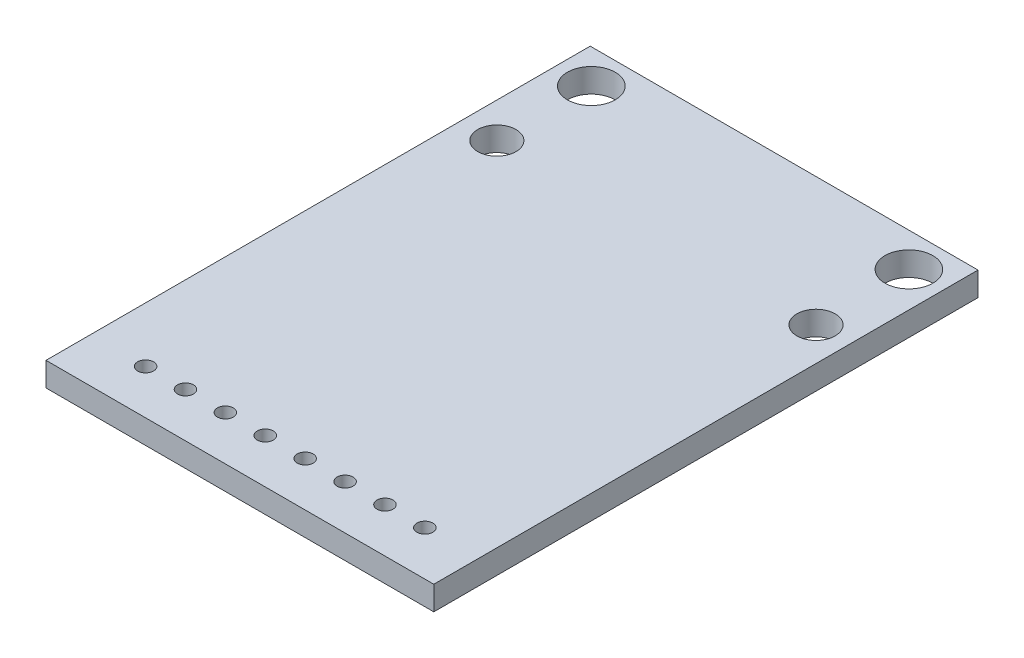
ISO-10303-21;
HEADER;
FILE_DESCRIPTION(('STEP AP214'),'2;1');
FILE_NAME('part.step','',(''),(''),'','','');
FILE_SCHEMA(('AUTOMOTIVE_DESIGN { 1 0 10303 214 1 1 1 1 }'));
ENDSEC;
DATA;
#1=APPLICATION_CONTEXT('core data for automotive mechanical design processes');
#2=APPLICATION_PROTOCOL_DEFINITION('international standard','automotive_design',2000,#1);
#3=PRODUCT_CONTEXT('',#1,'mechanical');
#4=PRODUCT('Part','Part','',(#3));
#5=PRODUCT_RELATED_PRODUCT_CATEGORY('part','',(#4));
#6=PRODUCT_DEFINITION_FORMATION('','',#4);
#7=PRODUCT_DEFINITION_CONTEXT('part definition',#1,'design');
#8=PRODUCT_DEFINITION('design','',#6,#7);
#9=PRODUCT_DEFINITION_SHAPE('','',#8);
#10=(LENGTH_UNIT() NAMED_UNIT(*) SI_UNIT(.MILLI.,.METRE.));
#11=(NAMED_UNIT(*) PLANE_ANGLE_UNIT() SI_UNIT($,.RADIAN.));
#12=(NAMED_UNIT(*) SI_UNIT($,.STERADIAN.) SOLID_ANGLE_UNIT());
#13=UNCERTAINTY_MEASURE_WITH_UNIT(LENGTH_MEASURE(1.E-05),#10,'distance_accuracy_value','');
#14=(GEOMETRIC_REPRESENTATION_CONTEXT(3) GLOBAL_UNCERTAINTY_ASSIGNED_CONTEXT((#13)) GLOBAL_UNIT_ASSIGNED_CONTEXT((#10,
#11,#12)) REPRESENTATION_CONTEXT('',''));
#15=CARTESIAN_POINT('',(0.,0.,0.));
#16=DIRECTION('',(0.,0.,1.));
#17=DIRECTION('',(1.,0.,0.));
#18=AXIS2_PLACEMENT_3D('',#15,#16,#17);
#19=CARTESIAN_POINT('',(12.15,1.5,-17.05));
#20=DIRECTION('',(-1.,0.,0.));
#21=DIRECTION('',(0.,0.,1.));
#22=AXIS2_PLACEMENT_3D('',#19,#20,#21);
#23=PLANE('',#22);
#24=DIRECTION('',(0.,0.,-1.));
#25=VECTOR('',#24,1.);
#26=CARTESIAN_POINT('',(12.15,0.,-17.05));
#27=LINE('',#26,#25);
#28=CARTESIAN_POINT('',(12.15,0.,17.05));
#29=VERTEX_POINT('',#28);
#30=CARTESIAN_POINT('',(12.15,0.,-17.05));
#31=VERTEX_POINT('',#30);
#32=EDGE_CURVE('E98',#29,#31,#27,.T.);
#33=ORIENTED_EDGE('',*,*,#32,.T.);
#34=DIRECTION('',(0.,-1.,0.));
#35=VECTOR('',#34,1.);
#36=CARTESIAN_POINT('',(12.15,1.5,-17.05));
#37=LINE('',#36,#35);
#38=CARTESIAN_POINT('',(12.15,1.5,-17.05));
#39=VERTEX_POINT('',#38);
#40=EDGE_CURVE('E11',#39,#31,#37,.T.);
#41=ORIENTED_EDGE('',*,*,#40,.F.);
#42=DIRECTION('',(0.,0.,-1.));
#43=VECTOR('',#42,1.);
#44=CARTESIAN_POINT('',(12.15,1.5,-17.05));
#45=LINE('',#44,#43);
#46=CARTESIAN_POINT('',(12.15,1.5,17.05));
#47=VERTEX_POINT('',#46);
#48=EDGE_CURVE('E86',#47,#39,#45,.T.);
#49=ORIENTED_EDGE('',*,*,#48,.F.);
#50=DIRECTION('',(0.,-1.,0.));
#51=VECTOR('',#50,1.);
#52=CARTESIAN_POINT('',(12.15,1.5,17.05));
#53=LINE('',#52,#51);
#54=EDGE_CURVE('E94',#47,#29,#53,.T.);
#55=ORIENTED_EDGE('',*,*,#54,.T.);
#56=EDGE_LOOP('',(#33,#41,#49,#55));
#57=FACE_BOUND('',#56,.T.);
#58=ADVANCED_FACE('F35',(#57),#23,.F.);
#59=CARTESIAN_POINT('',(-12.15,1.5,-17.05));
#60=DIRECTION('',(0.,0.,1.));
#61=DIRECTION('',(1.,0.,0.));
#62=AXIS2_PLACEMENT_3D('',#59,#60,#61);
#63=PLANE('',#62);
#64=DIRECTION('',(-1.,0.,0.));
#65=VECTOR('',#64,1.);
#66=CARTESIAN_POINT('',(-12.15,0.,-17.05));
#67=LINE('',#66,#65);
#68=CARTESIAN_POINT('',(-12.15,0.,-17.05));
#69=VERTEX_POINT('',#68);
#70=EDGE_CURVE('E90',#31,#69,#67,.T.);
#71=ORIENTED_EDGE('',*,*,#70,.T.);
#72=DIRECTION('',(0.,-1.,0.));
#73=VECTOR('',#72,1.);
#74=CARTESIAN_POINT('',(-12.15,1.5,-17.05));
#75=LINE('',#74,#73);
#76=CARTESIAN_POINT('',(-12.15,1.5,-17.05));
#77=VERTEX_POINT('',#76);
#78=EDGE_CURVE('E43',#77,#69,#75,.T.);
#79=ORIENTED_EDGE('',*,*,#78,.F.);
#80=DIRECTION('',(-1.,0.,0.));
#81=VECTOR('',#80,1.);
#82=CARTESIAN_POINT('',(-12.15,1.5,-17.05));
#83=LINE('',#82,#81);
#84=EDGE_CURVE('E81',#39,#77,#83,.T.);
#85=ORIENTED_EDGE('',*,*,#84,.F.);
#86=ORIENTED_EDGE('',*,*,#40,.T.);
#87=EDGE_LOOP('',(#71,#79,#85,#86));
#88=FACE_BOUND('',#87,.T.);
#89=ADVANCED_FACE('F89',(#88),#63,.F.);
#90=CARTESIAN_POINT('',(-12.15,1.5,-17.05));
#91=DIRECTION('',(1.,0.,0.));
#92=DIRECTION('',(0.,0.,-1.));
#93=AXIS2_PLACEMENT_3D('',#90,#91,#92);
#94=PLANE('',#93);
#95=DIRECTION('',(0.,0.,1.));
#96=VECTOR('',#95,1.);
#97=CARTESIAN_POINT('',(-12.15,0.,-17.05));
#98=LINE('',#97,#96);
#99=CARTESIAN_POINT('',(-12.15,0.,17.05));
#100=VERTEX_POINT('',#99);
#101=EDGE_CURVE('E68',#69,#100,#98,.T.);
#102=ORIENTED_EDGE('',*,*,#101,.T.);
#103=DIRECTION('',(0.,-1.,0.));
#104=VECTOR('',#103,1.);
#105=CARTESIAN_POINT('',(-12.15,1.5,17.05));
#106=LINE('',#105,#104);
#107=CARTESIAN_POINT('',(-12.15,1.5,17.05));
#108=VERTEX_POINT('',#107);
#109=EDGE_CURVE('E91',#108,#100,#106,.T.);
#110=ORIENTED_EDGE('',*,*,#109,.F.);
#111=DIRECTION('',(0.,0.,1.));
#112=VECTOR('',#111,1.);
#113=CARTESIAN_POINT('',(-12.15,1.5,-17.05));
#114=LINE('',#113,#112);
#115=EDGE_CURVE('E84',#77,#108,#114,.T.);
#116=ORIENTED_EDGE('',*,*,#115,.F.);
#117=ORIENTED_EDGE('',*,*,#78,.T.);
#118=EDGE_LOOP('',(#102,#110,#116,#117));
#119=FACE_BOUND('',#118,.T.);
#120=ADVANCED_FACE('F92',(#119),#94,.F.);
#121=CARTESIAN_POINT('',(-12.15,1.5,17.05));
#122=DIRECTION('',(0.,0.,-1.));
#123=DIRECTION('',(-1.,0.,0.));
#124=AXIS2_PLACEMENT_3D('',#121,#122,#123);
#125=PLANE('',#124);
#126=DIRECTION('',(1.,0.,0.));
#127=VECTOR('',#126,1.);
#128=CARTESIAN_POINT('',(-12.15,0.,17.05));
#129=LINE('',#128,#127);
#130=EDGE_CURVE('E74',#100,#29,#129,.T.);
#131=ORIENTED_EDGE('',*,*,#130,.T.);
#132=ORIENTED_EDGE('',*,*,#54,.F.);
#133=DIRECTION('',(1.,0.,0.));
#134=VECTOR('',#133,1.);
#135=CARTESIAN_POINT('',(-12.15,1.5,17.05));
#136=LINE('',#135,#134);
#137=EDGE_CURVE('E51',#108,#47,#136,.T.);
#138=ORIENTED_EDGE('',*,*,#137,.F.);
#139=ORIENTED_EDGE('',*,*,#109,.T.);
#140=EDGE_LOOP('',(#131,#132,#138,#139));
#141=FACE_BOUND('',#140,.T.);
#142=ADVANCED_FACE('F106',(#141),#125,.F.);
#143=CARTESIAN_POINT('',(0.,1.5,0.));
#144=DIRECTION('',(0.,1.,0.));
#145=DIRECTION('',(0.,0.,1.));
#146=AXIS2_PLACEMENT_3D('',#143,#144,#145);
#147=PLANE('',#146);
#148=CARTESIAN_POINT('',(8.8,1.5,14.26));
#149=DIRECTION('',(0.,1.,0.));
#150=DIRECTION('',(0.,0.,1.));
#151=AXIS2_PLACEMENT_3D('',#148,#149,#150);
#152=CIRCLE('',#151,0.500000000000001);
#153=CARTESIAN_POINT('',(8.8,1.5,14.76));
#154=VERTEX_POINT('',#153);
#155=EDGE_CURVE('E180',#154,#154,#152,.T.);
#156=ORIENTED_EDGE('',*,*,#155,.F.);
#157=EDGE_LOOP('',(#156));
#158=FACE_BOUND('',#157,.T.);
#159=CARTESIAN_POINT('',(6.3,1.5,14.26));
#160=DIRECTION('',(0.,1.,0.));
#161=DIRECTION('',(0.,0.,1.));
#162=AXIS2_PLACEMENT_3D('',#159,#160,#161);
#163=CIRCLE('',#162,0.500000000000001);
#164=CARTESIAN_POINT('',(6.3,1.5,14.76));
#165=VERTEX_POINT('',#164);
#166=EDGE_CURVE('E174',#165,#165,#163,.T.);
#167=ORIENTED_EDGE('',*,*,#166,.F.);
#168=EDGE_LOOP('',(#167));
#169=FACE_BOUND('',#168,.T.);
#170=CARTESIAN_POINT('',(3.8,1.5,14.26));
#171=DIRECTION('',(0.,1.,0.));
#172=DIRECTION('',(0.,0.,1.));
#173=AXIS2_PLACEMENT_3D('',#170,#171,#172);
#174=CIRCLE('',#173,0.500000000000001);
#175=CARTESIAN_POINT('',(3.8,1.5,14.76));
#176=VERTEX_POINT('',#175);
#177=EDGE_CURVE('E168',#176,#176,#174,.T.);
#178=ORIENTED_EDGE('',*,*,#177,.F.);
#179=EDGE_LOOP('',(#178));
#180=FACE_BOUND('',#179,.T.);
#181=CARTESIAN_POINT('',(1.3,1.5,14.26));
#182=DIRECTION('',(0.,1.,0.));
#183=DIRECTION('',(0.,0.,1.));
#184=AXIS2_PLACEMENT_3D('',#181,#182,#183);
#185=CIRCLE('',#184,0.500000000000001);
#186=CARTESIAN_POINT('',(1.3,1.5,14.76));
#187=VERTEX_POINT('',#186);
#188=EDGE_CURVE('E162',#187,#187,#185,.T.);
#189=ORIENTED_EDGE('',*,*,#188,.F.);
#190=EDGE_LOOP('',(#189));
#191=FACE_BOUND('',#190,.T.);
#192=CARTESIAN_POINT('',(-1.2,1.5,14.26));
#193=DIRECTION('',(0.,1.,0.));
#194=DIRECTION('',(0.,0.,1.));
#195=AXIS2_PLACEMENT_3D('',#192,#193,#194);
#196=CIRCLE('',#195,0.500000000000001);
#197=CARTESIAN_POINT('',(-1.2,1.5,14.76));
#198=VERTEX_POINT('',#197);
#199=EDGE_CURVE('E156',#198,#198,#196,.T.);
#200=ORIENTED_EDGE('',*,*,#199,.F.);
#201=EDGE_LOOP('',(#200));
#202=FACE_BOUND('',#201,.T.);
#203=CARTESIAN_POINT('',(-3.7,1.5,14.26));
#204=DIRECTION('',(0.,1.,0.));
#205=DIRECTION('',(0.,0.,1.));
#206=AXIS2_PLACEMENT_3D('',#203,#204,#205);
#207=CIRCLE('',#206,0.500000000000001);
#208=CARTESIAN_POINT('',(-3.7,1.5,14.76));
#209=VERTEX_POINT('',#208);
#210=EDGE_CURVE('E150',#209,#209,#207,.T.);
#211=ORIENTED_EDGE('',*,*,#210,.F.);
#212=EDGE_LOOP('',(#211));
#213=FACE_BOUND('',#212,.T.);
#214=CARTESIAN_POINT('',(-6.2,1.5,14.26));
#215=DIRECTION('',(0.,1.,0.));
#216=DIRECTION('',(0.,0.,1.));
#217=AXIS2_PLACEMENT_3D('',#214,#215,#216);
#218=CIRCLE('',#217,0.500000000000001);
#219=CARTESIAN_POINT('',(-6.2,1.5,14.76));
#220=VERTEX_POINT('',#219);
#221=EDGE_CURVE('E144',#220,#220,#218,.T.);
#222=ORIENTED_EDGE('',*,*,#221,.F.);
#223=EDGE_LOOP('',(#222));
#224=FACE_BOUND('',#223,.T.);
#225=CARTESIAN_POINT('',(-8.7,1.5,14.26));
#226=DIRECTION('',(0.,1.,0.));
#227=DIRECTION('',(0.,0.,1.));
#228=AXIS2_PLACEMENT_3D('',#225,#226,#227);
#229=CIRCLE('',#228,0.500000000000001);
#230=CARTESIAN_POINT('',(-8.7,1.5,14.76));
#231=VERTEX_POINT('',#230);
#232=EDGE_CURVE('E138',#231,#231,#229,.T.);
#233=ORIENTED_EDGE('',*,*,#232,.F.);
#234=EDGE_LOOP('',(#233));
#235=FACE_BOUND('',#234,.T.);
#236=CARTESIAN_POINT('',(-9.95,1.5,-9.));
#237=DIRECTION('',(0.,1.,0.));
#238=DIRECTION('',(0.,0.,1.));
#239=AXIS2_PLACEMENT_3D('',#236,#237,#238);
#240=CIRCLE('',#239,1.19999999999999);
#241=CARTESIAN_POINT('',(-9.95,1.5,-7.80000000000001));
#242=VERTEX_POINT('',#241);
#243=EDGE_CURVE('E132',#242,#242,#240,.T.);
#244=ORIENTED_EDGE('',*,*,#243,.F.);
#245=EDGE_LOOP('',(#244));
#246=FACE_BOUND('',#245,.T.);
#247=CARTESIAN_POINT('',(10.05,1.5,-9.));
#248=DIRECTION('',(0.,1.,0.));
#249=DIRECTION('',(0.,0.,1.));
#250=AXIS2_PLACEMENT_3D('',#247,#248,#249);
#251=CIRCLE('',#250,1.19999999999999);
#252=CARTESIAN_POINT('',(10.05,1.5,-7.80000000000001));
#253=VERTEX_POINT('',#252);
#254=EDGE_CURVE('E126',#253,#253,#251,.T.);
#255=ORIENTED_EDGE('',*,*,#254,.F.);
#256=EDGE_LOOP('',(#255));
#257=FACE_BOUND('',#256,.T.);
#258=CARTESIAN_POINT('',(-9.95,1.5,-14.92));
#259=DIRECTION('',(0.,1.,0.));
#260=DIRECTION('',(0.,0.,1.));
#261=AXIS2_PLACEMENT_3D('',#258,#259,#260);
#262=CIRCLE('',#261,1.5);
#263=CARTESIAN_POINT('',(-9.95,1.5,-13.42));
#264=VERTEX_POINT('',#263);
#265=EDGE_CURVE('E120',#264,#264,#262,.T.);
#266=ORIENTED_EDGE('',*,*,#265,.F.);
#267=EDGE_LOOP('',(#266));
#268=FACE_BOUND('',#267,.T.);
#269=CARTESIAN_POINT('',(9.95,1.5,-14.92));
#270=DIRECTION('',(0.,1.,0.));
#271=DIRECTION('',(0.,0.,1.));
#272=AXIS2_PLACEMENT_3D('',#269,#270,#271);
#273=CIRCLE('',#272,1.5);
#274=CARTESIAN_POINT('',(9.95,1.5,-13.42));
#275=VERTEX_POINT('',#274);
#276=EDGE_CURVE('E114',#275,#275,#273,.T.);
#277=ORIENTED_EDGE('',*,*,#276,.F.);
#278=EDGE_LOOP('',(#277));
#279=FACE_BOUND('',#278,.T.);
#280=ORIENTED_EDGE('',*,*,#48,.T.);
#281=ORIENTED_EDGE('',*,*,#84,.T.);
#282=ORIENTED_EDGE('',*,*,#115,.T.);
#283=ORIENTED_EDGE('',*,*,#137,.T.);
#284=EDGE_LOOP('',(#280,#281,#282,#283));
#285=FACE_BOUND('',#284,.T.);
#286=ADVANCED_FACE('F82',(#158,#169,#180,#191,#202,#213,#224,#235,#246,#257,#268,#279,#285),
#147,.T.);
#287=CARTESIAN_POINT('',(0.,0.,0.));
#288=DIRECTION('',(0.,1.,0.));
#289=DIRECTION('',(0.,0.,1.));
#290=AXIS2_PLACEMENT_3D('',#287,#288,#289);
#291=PLANE('',#290);
#292=CARTESIAN_POINT('',(8.8,0.,14.26));
#293=DIRECTION('',(0.,1.,0.));
#294=DIRECTION('',(0.,0.,1.));
#295=AXIS2_PLACEMENT_3D('',#292,#293,#294);
#296=CIRCLE('',#295,0.500000000000001);
#297=CARTESIAN_POINT('',(8.8,0.,14.76));
#298=VERTEX_POINT('',#297);
#299=EDGE_CURVE('E177',#298,#298,#296,.F.);
#300=ORIENTED_EDGE('',*,*,#299,.F.);
#301=EDGE_LOOP('',(#300));
#302=FACE_BOUND('',#301,.T.);
#303=CARTESIAN_POINT('',(6.3,0.,14.26));
#304=DIRECTION('',(0.,1.,0.));
#305=DIRECTION('',(0.,0.,1.));
#306=AXIS2_PLACEMENT_3D('',#303,#304,#305);
#307=CIRCLE('',#306,0.500000000000001);
#308=CARTESIAN_POINT('',(6.3,0.,14.76));
#309=VERTEX_POINT('',#308);
#310=EDGE_CURVE('E171',#309,#309,#307,.F.);
#311=ORIENTED_EDGE('',*,*,#310,.F.);
#312=EDGE_LOOP('',(#311));
#313=FACE_BOUND('',#312,.T.);
#314=CARTESIAN_POINT('',(3.8,0.,14.26));
#315=DIRECTION('',(0.,1.,0.));
#316=DIRECTION('',(0.,0.,1.));
#317=AXIS2_PLACEMENT_3D('',#314,#315,#316);
#318=CIRCLE('',#317,0.500000000000001);
#319=CARTESIAN_POINT('',(3.8,0.,14.76));
#320=VERTEX_POINT('',#319);
#321=EDGE_CURVE('E165',#320,#320,#318,.F.);
#322=ORIENTED_EDGE('',*,*,#321,.F.);
#323=EDGE_LOOP('',(#322));
#324=FACE_BOUND('',#323,.T.);
#325=CARTESIAN_POINT('',(1.3,0.,14.26));
#326=DIRECTION('',(0.,1.,0.));
#327=DIRECTION('',(0.,0.,1.));
#328=AXIS2_PLACEMENT_3D('',#325,#326,#327);
#329=CIRCLE('',#328,0.500000000000001);
#330=CARTESIAN_POINT('',(1.3,0.,14.76));
#331=VERTEX_POINT('',#330);
#332=EDGE_CURVE('E159',#331,#331,#329,.F.);
#333=ORIENTED_EDGE('',*,*,#332,.F.);
#334=EDGE_LOOP('',(#333));
#335=FACE_BOUND('',#334,.T.);
#336=CARTESIAN_POINT('',(-1.2,0.,14.26));
#337=DIRECTION('',(0.,1.,0.));
#338=DIRECTION('',(0.,0.,1.));
#339=AXIS2_PLACEMENT_3D('',#336,#337,#338);
#340=CIRCLE('',#339,0.500000000000001);
#341=CARTESIAN_POINT('',(-1.2,0.,14.76));
#342=VERTEX_POINT('',#341);
#343=EDGE_CURVE('E153',#342,#342,#340,.F.);
#344=ORIENTED_EDGE('',*,*,#343,.F.);
#345=EDGE_LOOP('',(#344));
#346=FACE_BOUND('',#345,.T.);
#347=CARTESIAN_POINT('',(-3.7,0.,14.26));
#348=DIRECTION('',(0.,1.,0.));
#349=DIRECTION('',(0.,0.,1.));
#350=AXIS2_PLACEMENT_3D('',#347,#348,#349);
#351=CIRCLE('',#350,0.500000000000001);
#352=CARTESIAN_POINT('',(-3.7,0.,14.76));
#353=VERTEX_POINT('',#352);
#354=EDGE_CURVE('E147',#353,#353,#351,.F.);
#355=ORIENTED_EDGE('',*,*,#354,.F.);
#356=EDGE_LOOP('',(#355));
#357=FACE_BOUND('',#356,.T.);
#358=CARTESIAN_POINT('',(-6.2,0.,14.26));
#359=DIRECTION('',(0.,1.,0.));
#360=DIRECTION('',(0.,0.,1.));
#361=AXIS2_PLACEMENT_3D('',#358,#359,#360);
#362=CIRCLE('',#361,0.500000000000001);
#363=CARTESIAN_POINT('',(-6.2,0.,14.76));
#364=VERTEX_POINT('',#363);
#365=EDGE_CURVE('E141',#364,#364,#362,.F.);
#366=ORIENTED_EDGE('',*,*,#365,.F.);
#367=EDGE_LOOP('',(#366));
#368=FACE_BOUND('',#367,.T.);
#369=CARTESIAN_POINT('',(-8.7,0.,14.26));
#370=DIRECTION('',(0.,1.,0.));
#371=DIRECTION('',(0.,0.,1.));
#372=AXIS2_PLACEMENT_3D('',#369,#370,#371);
#373=CIRCLE('',#372,0.500000000000001);
#374=CARTESIAN_POINT('',(-8.7,0.,14.76));
#375=VERTEX_POINT('',#374);
#376=EDGE_CURVE('E135',#375,#375,#373,.F.);
#377=ORIENTED_EDGE('',*,*,#376,.F.);
#378=EDGE_LOOP('',(#377));
#379=FACE_BOUND('',#378,.T.);
#380=CARTESIAN_POINT('',(-9.95,0.,-9.));
#381=DIRECTION('',(0.,1.,0.));
#382=DIRECTION('',(0.,0.,1.));
#383=AXIS2_PLACEMENT_3D('',#380,#381,#382);
#384=CIRCLE('',#383,1.19999999999999);
#385=CARTESIAN_POINT('',(-9.95,0.,-7.80000000000001));
#386=VERTEX_POINT('',#385);
#387=EDGE_CURVE('E129',#386,#386,#384,.T.);
#388=ORIENTED_EDGE('',*,*,#387,.T.);
#389=EDGE_LOOP('',(#388));
#390=FACE_BOUND('',#389,.T.);
#391=CARTESIAN_POINT('',(10.05,0.,-9.));
#392=DIRECTION('',(0.,1.,0.));
#393=DIRECTION('',(0.,0.,1.));
#394=AXIS2_PLACEMENT_3D('',#391,#392,#393);
#395=CIRCLE('',#394,1.19999999999999);
#396=CARTESIAN_POINT('',(10.05,0.,-7.80000000000001));
#397=VERTEX_POINT('',#396);
#398=EDGE_CURVE('E123',#397,#397,#395,.T.);
#399=ORIENTED_EDGE('',*,*,#398,.T.);
#400=EDGE_LOOP('',(#399));
#401=FACE_BOUND('',#400,.T.);
#402=CARTESIAN_POINT('',(-9.95,0.,-14.92));
#403=DIRECTION('',(0.,1.,0.));
#404=DIRECTION('',(0.,0.,1.));
#405=AXIS2_PLACEMENT_3D('',#402,#403,#404);
#406=CIRCLE('',#405,1.5);
#407=CARTESIAN_POINT('',(-9.95,0.,-13.42));
#408=VERTEX_POINT('',#407);
#409=EDGE_CURVE('E117',#408,#408,#406,.T.);
#410=ORIENTED_EDGE('',*,*,#409,.T.);
#411=EDGE_LOOP('',(#410));
#412=FACE_BOUND('',#411,.T.);
#413=CARTESIAN_POINT('',(9.95,0.,-14.92));
#414=DIRECTION('',(0.,1.,0.));
#415=DIRECTION('',(0.,0.,1.));
#416=AXIS2_PLACEMENT_3D('',#413,#414,#415);
#417=CIRCLE('',#416,1.5);
#418=CARTESIAN_POINT('',(9.95,0.,-13.42));
#419=VERTEX_POINT('',#418);
#420=EDGE_CURVE('E101',#419,#419,#417,.T.);
#421=ORIENTED_EDGE('',*,*,#420,.T.);
#422=EDGE_LOOP('',(#421));
#423=FACE_BOUND('',#422,.T.);
#424=ORIENTED_EDGE('',*,*,#32,.F.);
#425=ORIENTED_EDGE('',*,*,#130,.F.);
#426=ORIENTED_EDGE('',*,*,#101,.F.);
#427=ORIENTED_EDGE('',*,*,#70,.F.);
#428=EDGE_LOOP('',(#424,#425,#426,#427));
#429=FACE_BOUND('',#428,.T.);
#430=ADVANCED_FACE('F109',(#302,#313,#324,#335,#346,#357,#368,#379,#390,#401,#412,#423,#429),
#291,.F.);
#431=CARTESIAN_POINT('',(9.95,1.5,-14.92));
#432=DIRECTION('',(0.,1.,0.));
#433=DIRECTION('',(0.,0.,1.));
#434=AXIS2_PLACEMENT_3D('',#431,#432,#433);
#435=CYLINDRICAL_SURFACE('',#434,1.5);
#436=ORIENTED_EDGE('',*,*,#420,.F.);
#437=EDGE_LOOP('',(#436));
#438=FACE_BOUND('',#437,.T.);
#439=ORIENTED_EDGE('',*,*,#276,.T.);
#440=EDGE_LOOP('',(#439));
#441=FACE_BOUND('',#440,.T.);
#442=ADVANCED_FACE('F212',(#438,#441),#435,.F.);
#443=CARTESIAN_POINT('',(-9.95,1.5,-14.92));
#444=DIRECTION('',(0.,1.,0.));
#445=DIRECTION('',(0.,0.,1.));
#446=AXIS2_PLACEMENT_3D('',#443,#444,#445);
#447=CYLINDRICAL_SURFACE('',#446,1.5);
#448=ORIENTED_EDGE('',*,*,#409,.F.);
#449=EDGE_LOOP('',(#448));
#450=FACE_BOUND('',#449,.T.);
#451=ORIENTED_EDGE('',*,*,#265,.T.);
#452=EDGE_LOOP('',(#451));
#453=FACE_BOUND('',#452,.T.);
#454=ADVANCED_FACE('F214',(#450,#453),#447,.F.);
#455=CARTESIAN_POINT('',(10.05,1.5,-9.));
#456=DIRECTION('',(0.,1.,0.));
#457=DIRECTION('',(0.,0.,1.));
#458=AXIS2_PLACEMENT_3D('',#455,#456,#457);
#459=CYLINDRICAL_SURFACE('',#458,1.19999999999999);
#460=ORIENTED_EDGE('',*,*,#398,.F.);
#461=EDGE_LOOP('',(#460));
#462=FACE_BOUND('',#461,.T.);
#463=ORIENTED_EDGE('',*,*,#254,.T.);
#464=EDGE_LOOP('',(#463));
#465=FACE_BOUND('',#464,.T.);
#466=ADVANCED_FACE('F221',(#462,#465),#459,.F.);
#467=CARTESIAN_POINT('',(-9.95,1.5,-9.));
#468=DIRECTION('',(0.,1.,0.));
#469=DIRECTION('',(0.,0.,1.));
#470=AXIS2_PLACEMENT_3D('',#467,#468,#469);
#471=CYLINDRICAL_SURFACE('',#470,1.19999999999999);
#472=ORIENTED_EDGE('',*,*,#387,.F.);
#473=EDGE_LOOP('',(#472));
#474=FACE_BOUND('',#473,.T.);
#475=ORIENTED_EDGE('',*,*,#243,.T.);
#476=EDGE_LOOP('',(#475));
#477=FACE_BOUND('',#476,.T.);
#478=ADVANCED_FACE('F262',(#474,#477),#471,.F.);
#479=CARTESIAN_POINT('',(-8.7,-0.00100000000000122,14.26));
#480=DIRECTION('',(0.,1.,0.));
#481=DIRECTION('',(0.,0.,1.));
#482=AXIS2_PLACEMENT_3D('',#479,#480,#481);
#483=CYLINDRICAL_SURFACE('',#482,0.500000000000001);
#484=ORIENTED_EDGE('',*,*,#232,.T.);
#485=EDGE_LOOP('',(#484));
#486=FACE_BOUND('',#485,.T.);
#487=ORIENTED_EDGE('',*,*,#376,.T.);
#488=EDGE_LOOP('',(#487));
#489=FACE_BOUND('',#488,.T.);
#490=ADVANCED_FACE('F256',(#486,#489),#483,.F.);
#491=CARTESIAN_POINT('',(-6.2,-0.00100000000000122,14.26));
#492=DIRECTION('',(0.,1.,0.));
#493=DIRECTION('',(0.,0.,1.));
#494=AXIS2_PLACEMENT_3D('',#491,#492,#493);
#495=CYLINDRICAL_SURFACE('',#494,0.500000000000001);
#496=ORIENTED_EDGE('',*,*,#221,.T.);
#497=EDGE_LOOP('',(#496));
#498=FACE_BOUND('',#497,.T.);
#499=ORIENTED_EDGE('',*,*,#365,.T.);
#500=EDGE_LOOP('',(#499));
#501=FACE_BOUND('',#500,.T.);
#502=ADVANCED_FACE('F261',(#498,#501),#495,.F.);
#503=CARTESIAN_POINT('',(-3.7,-0.00100000000000122,14.26));
#504=DIRECTION('',(0.,1.,0.));
#505=DIRECTION('',(0.,0.,1.));
#506=AXIS2_PLACEMENT_3D('',#503,#504,#505);
#507=CYLINDRICAL_SURFACE('',#506,0.500000000000001);
#508=ORIENTED_EDGE('',*,*,#210,.T.);
#509=EDGE_LOOP('',(#508));
#510=FACE_BOUND('',#509,.T.);
#511=ORIENTED_EDGE('',*,*,#354,.T.);
#512=EDGE_LOOP('',(#511));
#513=FACE_BOUND('',#512,.T.);
#514=ADVANCED_FACE('F274',(#510,#513),#507,.F.);
#515=CARTESIAN_POINT('',(-1.2,-0.00100000000000122,14.26));
#516=DIRECTION('',(0.,1.,0.));
#517=DIRECTION('',(0.,0.,1.));
#518=AXIS2_PLACEMENT_3D('',#515,#516,#517);
#519=CYLINDRICAL_SURFACE('',#518,0.500000000000001);
#520=ORIENTED_EDGE('',*,*,#199,.T.);
#521=EDGE_LOOP('',(#520));
#522=FACE_BOUND('',#521,.T.);
#523=ORIENTED_EDGE('',*,*,#343,.T.);
#524=EDGE_LOOP('',(#523));
#525=FACE_BOUND('',#524,.T.);
#526=ADVANCED_FACE('F284',(#522,#525),#519,.F.);
#527=CARTESIAN_POINT('',(1.3,-0.00100000000000122,14.26));
#528=DIRECTION('',(0.,1.,0.));
#529=DIRECTION('',(0.,0.,1.));
#530=AXIS2_PLACEMENT_3D('',#527,#528,#529);
#531=CYLINDRICAL_SURFACE('',#530,0.500000000000001);
#532=ORIENTED_EDGE('',*,*,#188,.T.);
#533=EDGE_LOOP('',(#532));
#534=FACE_BOUND('',#533,.T.);
#535=ORIENTED_EDGE('',*,*,#332,.T.);
#536=EDGE_LOOP('',(#535));
#537=FACE_BOUND('',#536,.T.);
#538=ADVANCED_FACE('F294',(#534,#537),#531,.F.);
#539=CARTESIAN_POINT('',(3.8,-0.00100000000000122,14.26));
#540=DIRECTION('',(0.,1.,0.));
#541=DIRECTION('',(0.,0.,1.));
#542=AXIS2_PLACEMENT_3D('',#539,#540,#541);
#543=CYLINDRICAL_SURFACE('',#542,0.500000000000001);
#544=ORIENTED_EDGE('',*,*,#177,.T.);
#545=EDGE_LOOP('',(#544));
#546=FACE_BOUND('',#545,.T.);
#547=ORIENTED_EDGE('',*,*,#321,.T.);
#548=EDGE_LOOP('',(#547));
#549=FACE_BOUND('',#548,.T.);
#550=ADVANCED_FACE('F304',(#546,#549),#543,.F.);
#551=CARTESIAN_POINT('',(6.3,-0.00100000000000122,14.26));
#552=DIRECTION('',(0.,1.,0.));
#553=DIRECTION('',(0.,0.,1.));
#554=AXIS2_PLACEMENT_3D('',#551,#552,#553);
#555=CYLINDRICAL_SURFACE('',#554,0.500000000000001);
#556=ORIENTED_EDGE('',*,*,#166,.T.);
#557=EDGE_LOOP('',(#556));
#558=FACE_BOUND('',#557,.T.);
#559=ORIENTED_EDGE('',*,*,#310,.T.);
#560=EDGE_LOOP('',(#559));
#561=FACE_BOUND('',#560,.T.);
#562=ADVANCED_FACE('F314',(#558,#561),#555,.F.);
#563=CARTESIAN_POINT('',(8.8,-0.00100000000000122,14.26));
#564=DIRECTION('',(0.,1.,0.));
#565=DIRECTION('',(0.,0.,1.));
#566=AXIS2_PLACEMENT_3D('',#563,#564,#565);
#567=CYLINDRICAL_SURFACE('',#566,0.500000000000001);
#568=ORIENTED_EDGE('',*,*,#155,.T.);
#569=EDGE_LOOP('',(#568));
#570=FACE_BOUND('',#569,.T.);
#571=ORIENTED_EDGE('',*,*,#299,.T.);
#572=EDGE_LOOP('',(#571));
#573=FACE_BOUND('',#572,.T.);
#574=ADVANCED_FACE('F184',(#570,#573),#567,.F.);
#575=CLOSED_SHELL('',(#58,#89,#120,#142,#286,#430,#442,#454,#466,#478,#490,#502,#514,#526,#538,
#550,#562,#574));
#576=MANIFOLD_SOLID_BREP('B2',#575);
#577=ADVANCED_BREP_SHAPE_REPRESENTATION('',(#18,#576),#14);
#578=SHAPE_DEFINITION_REPRESENTATION(#9,#577);
ENDSEC;
END-ISO-10303-21;
